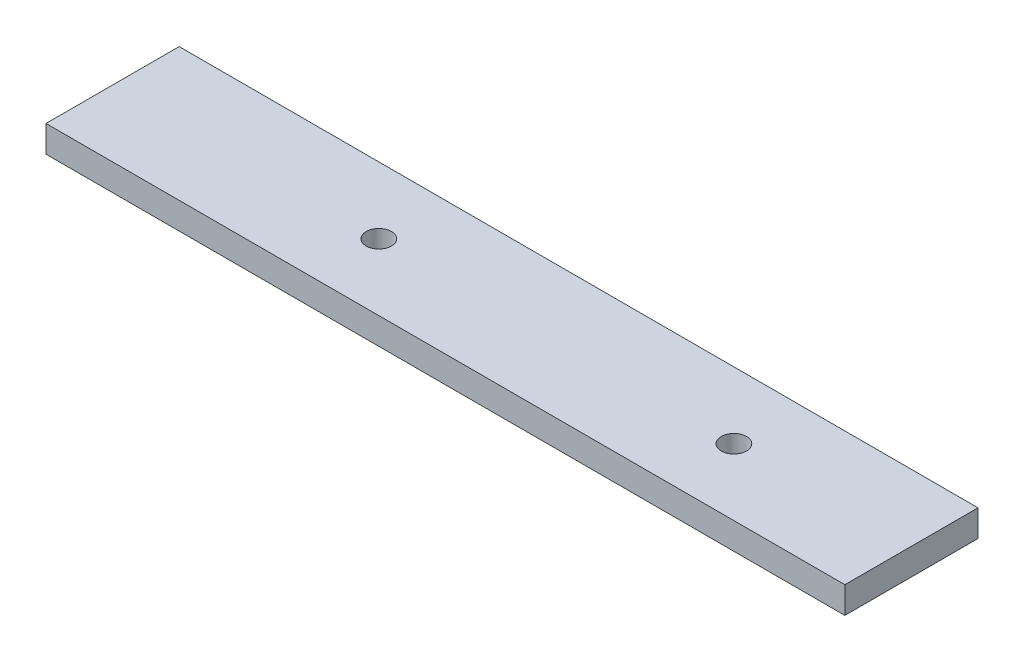
ISO-10303-21;
HEADER;
FILE_DESCRIPTION(('STEP AP214'),'2;1');
FILE_NAME('part.step','',(''),(''),'','','');
FILE_SCHEMA(('AUTOMOTIVE_DESIGN { 1 0 10303 214 1 1 1 1 }'));
ENDSEC;
DATA;
#1=APPLICATION_CONTEXT('core data for automotive mechanical design processes');
#2=APPLICATION_PROTOCOL_DEFINITION('international standard','automotive_design',2000,#1);
#3=PRODUCT_CONTEXT('',#1,'mechanical');
#4=PRODUCT('Part','Part','',(#3));
#5=PRODUCT_RELATED_PRODUCT_CATEGORY('part','',(#4));
#6=PRODUCT_DEFINITION_FORMATION('','',#4);
#7=PRODUCT_DEFINITION_CONTEXT('part definition',#1,'design');
#8=PRODUCT_DEFINITION('design','',#6,#7);
#9=PRODUCT_DEFINITION_SHAPE('','',#8);
#10=(LENGTH_UNIT() NAMED_UNIT(*) SI_UNIT(.MILLI.,.METRE.));
#11=(NAMED_UNIT(*) PLANE_ANGLE_UNIT() SI_UNIT($,.RADIAN.));
#12=(NAMED_UNIT(*) SI_UNIT($,.STERADIAN.) SOLID_ANGLE_UNIT());
#13=UNCERTAINTY_MEASURE_WITH_UNIT(LENGTH_MEASURE(1.E-05),#10,'distance_accuracy_value','');
#14=(GEOMETRIC_REPRESENTATION_CONTEXT(3) GLOBAL_UNCERTAINTY_ASSIGNED_CONTEXT((#13)) GLOBAL_UNIT_ASSIGNED_CONTEXT((#10,
#11,#12)) REPRESENTATION_CONTEXT('',''));
#15=CARTESIAN_POINT('',(0.,0.,0.));
#16=DIRECTION('',(0.,0.,1.));
#17=DIRECTION('',(1.,0.,0.));
#18=AXIS2_PLACEMENT_3D('',#15,#16,#17);
#19=CARTESIAN_POINT('',(-50.,3.,7.5));
#20=DIRECTION('',(0.,0.,-1.));
#21=DIRECTION('',(-1.,0.,0.));
#22=AXIS2_PLACEMENT_3D('',#19,#20,#21);
#23=PLANE('',#22);
#24=DIRECTION('',(1.,0.,0.));
#25=VECTOR('',#24,1.);
#26=CARTESIAN_POINT('',(-50.,3.,7.5));
#27=LINE('',#26,#25);
#28=CARTESIAN_POINT('',(-20.,3.,7.5));
#29=VERTEX_POINT('',#28);
#30=CARTESIAN_POINT('',(70.,3.,7.5));
#31=VERTEX_POINT('',#30);
#32=EDGE_CURVE('E11',#29,#31,#27,.T.);
#33=ORIENTED_EDGE('',*,*,#32,.F.);
#34=DIRECTION('',(0.,1.,0.));
#35=VECTOR('',#34,1.);
#36=CARTESIAN_POINT('',(-20.,-17.,7.5));
#37=LINE('',#36,#35);
#38=CARTESIAN_POINT('',(-20.,0.,7.5));
#39=VERTEX_POINT('',#38);
#40=EDGE_CURVE('E80',#39,#29,#37,.T.);
#41=ORIENTED_EDGE('',*,*,#40,.F.);
#42=DIRECTION('',(1.,0.,0.));
#43=VECTOR('',#42,1.);
#44=CARTESIAN_POINT('',(-50.,0.,7.5));
#45=LINE('',#44,#43);
#46=CARTESIAN_POINT('',(70.,0.,7.5));
#47=VERTEX_POINT('',#46);
#48=EDGE_CURVE('E96',#39,#47,#45,.T.);
#49=ORIENTED_EDGE('',*,*,#48,.T.);
#50=DIRECTION('',(0.,-1.,0.));
#51=VECTOR('',#50,1.);
#52=CARTESIAN_POINT('',(70.,3.,7.5));
#53=LINE('',#52,#51);
#54=EDGE_CURVE('E95',#31,#47,#53,.T.);
#55=ORIENTED_EDGE('',*,*,#54,.F.);
#56=EDGE_LOOP('',(#33,#41,#49,#55));
#57=FACE_BOUND('',#56,.T.);
#58=ADVANCED_FACE('F39',(#57),#23,.F.);
#59=CARTESIAN_POINT('',(0.,3.,0.));
#60=DIRECTION('',(0.,-1.,0.));
#61=DIRECTION('',(0.,0.,-1.));
#62=AXIS2_PLACEMENT_3D('',#59,#60,#61);
#63=PLANE('',#62);
#64=CARTESIAN_POINT('',(50.,3.,0.));
#65=DIRECTION('',(0.,1.,0.));
#66=DIRECTION('',(0.,0.,1.));
#67=AXIS2_PLACEMENT_3D('',#64,#65,#66);
#68=CIRCLE('',#67,1.425);
#69=CARTESIAN_POINT('',(50.,3.,1.425));
#70=VERTEX_POINT('',#69);
#71=EDGE_CURVE('E125',#70,#70,#68,.T.);
#72=ORIENTED_EDGE('',*,*,#71,.F.);
#73=EDGE_LOOP('',(#72));
#74=FACE_BOUND('',#73,.T.);
#75=CARTESIAN_POINT('',(9.99999999999999,3.,0.));
#76=DIRECTION('',(0.,1.,0.));
#77=DIRECTION('',(0.,0.,1.));
#78=AXIS2_PLACEMENT_3D('',#75,#76,#77);
#79=CIRCLE('',#78,1.425);
#80=CARTESIAN_POINT('',(9.99999999999999,3.,1.425));
#81=VERTEX_POINT('',#80);
#82=EDGE_CURVE('E132',#81,#81,#79,.T.);
#83=ORIENTED_EDGE('',*,*,#82,.F.);
#84=EDGE_LOOP('',(#83));
#85=FACE_BOUND('',#84,.T.);
#86=DIRECTION('',(-1.,0.,0.));
#87=VECTOR('',#86,1.);
#88=CARTESIAN_POINT('',(-50.,3.,-7.5));
#89=LINE('',#88,#87);
#90=CARTESIAN_POINT('',(70.,3.,-7.5));
#91=VERTEX_POINT('',#90);
#92=CARTESIAN_POINT('',(-20.,3.,-7.5));
#93=VERTEX_POINT('',#92);
#94=EDGE_CURVE('E49',#91,#93,#89,.T.);
#95=ORIENTED_EDGE('',*,*,#94,.T.);
#96=DIRECTION('',(0.,0.,-1.));
#97=VECTOR('',#96,1.);
#98=CARTESIAN_POINT('',(-20.,3.,-7.5));
#99=LINE('',#98,#97);
#100=EDGE_CURVE('E57',#29,#93,#99,.T.);
#101=ORIENTED_EDGE('',*,*,#100,.F.);
#102=ORIENTED_EDGE('',*,*,#32,.T.);
#103=DIRECTION('',(0.,0.,1.));
#104=VECTOR('',#103,1.);
#105=CARTESIAN_POINT('',(70.,3.,7.5));
#106=LINE('',#105,#104);
#107=EDGE_CURVE('E112',#91,#31,#106,.T.);
#108=ORIENTED_EDGE('',*,*,#107,.F.);
#109=EDGE_LOOP('',(#95,#101,#102,#108));
#110=FACE_BOUND('',#109,.T.);
#111=ADVANCED_FACE('F90',(#74,#85,#110),#63,.F.);
#112=CARTESIAN_POINT('',(0.,0.,0.));
#113=DIRECTION('',(0.,-1.,0.));
#114=DIRECTION('',(0.,0.,-1.));
#115=AXIS2_PLACEMENT_3D('',#112,#113,#114);
#116=PLANE('',#115);
#117=CARTESIAN_POINT('',(50.,0.,0.));
#118=DIRECTION('',(0.,-1.,0.));
#119=DIRECTION('',(0.,0.,-1.));
#120=AXIS2_PLACEMENT_3D('',#117,#118,#119);
#121=CIRCLE('',#120,1.425);
#122=CARTESIAN_POINT('',(50.,0.,-1.425));
#123=VERTEX_POINT('',#122);
#124=EDGE_CURVE('E43',#123,#123,#121,.T.);
#125=ORIENTED_EDGE('',*,*,#124,.F.);
#126=EDGE_LOOP('',(#125));
#127=FACE_BOUND('',#126,.T.);
#128=CARTESIAN_POINT('',(9.99999999999999,0.,0.));
#129=DIRECTION('',(0.,-1.,0.));
#130=DIRECTION('',(0.,0.,-1.));
#131=AXIS2_PLACEMENT_3D('',#128,#129,#130);
#132=CIRCLE('',#131,1.425);
#133=CARTESIAN_POINT('',(9.99999999999999,0.,-1.425));
#134=VERTEX_POINT('',#133);
#135=EDGE_CURVE('E122',#134,#134,#132,.T.);
#136=ORIENTED_EDGE('',*,*,#135,.F.);
#137=EDGE_LOOP('',(#136));
#138=FACE_BOUND('',#137,.T.);
#139=DIRECTION('',(0.,0.,1.));
#140=VECTOR('',#139,1.);
#141=CARTESIAN_POINT('',(-20.,0.,0.));
#142=LINE('',#141,#140);
#143=CARTESIAN_POINT('',(-20.,0.,-7.5));
#144=VERTEX_POINT('',#143);
#145=EDGE_CURVE('E83',#144,#39,#142,.T.);
#146=ORIENTED_EDGE('',*,*,#145,.F.);
#147=DIRECTION('',(-1.,0.,0.));
#148=VECTOR('',#147,1.);
#149=CARTESIAN_POINT('',(-50.,0.,-7.5));
#150=LINE('',#149,#148);
#151=CARTESIAN_POINT('',(70.,0.,-7.5));
#152=VERTEX_POINT('',#151);
#153=EDGE_CURVE('E115',#152,#144,#150,.T.);
#154=ORIENTED_EDGE('',*,*,#153,.F.);
#155=DIRECTION('',(0.,0.,-1.));
#156=VECTOR('',#155,1.);
#157=CARTESIAN_POINT('',(70.,0.,7.5));
#158=LINE('',#157,#156);
#159=EDGE_CURVE('E101',#47,#152,#158,.T.);
#160=ORIENTED_EDGE('',*,*,#159,.F.);
#161=ORIENTED_EDGE('',*,*,#48,.F.);
#162=EDGE_LOOP('',(#146,#154,#160,#161));
#163=FACE_BOUND('',#162,.T.);
#164=ADVANCED_FACE('F144',(#127,#138,#163),#116,.T.);
#165=CARTESIAN_POINT('',(-50.,3.,-7.5));
#166=DIRECTION('',(0.,0.,1.));
#167=DIRECTION('',(1.,0.,0.));
#168=AXIS2_PLACEMENT_3D('',#165,#166,#167);
#169=PLANE('',#168);
#170=ORIENTED_EDGE('',*,*,#153,.T.);
#171=DIRECTION('',(0.,1.,0.));
#172=VECTOR('',#171,1.);
#173=CARTESIAN_POINT('',(-20.,-17.,-7.5));
#174=LINE('',#173,#172);
#175=EDGE_CURVE('E87',#144,#93,#174,.T.);
#176=ORIENTED_EDGE('',*,*,#175,.T.);
#177=ORIENTED_EDGE('',*,*,#94,.F.);
#178=DIRECTION('',(0.,1.,0.));
#179=VECTOR('',#178,1.);
#180=CARTESIAN_POINT('',(70.,3.,-7.5));
#181=LINE('',#180,#179);
#182=EDGE_CURVE('E105',#152,#91,#181,.T.);
#183=ORIENTED_EDGE('',*,*,#182,.F.);
#184=EDGE_LOOP('',(#170,#176,#177,#183));
#185=FACE_BOUND('',#184,.T.);
#186=ADVANCED_FACE('F41',(#185),#169,.F.);
#187=CARTESIAN_POINT('',(70.,0.,0.));
#188=DIRECTION('',(1.,0.,0.));
#189=DIRECTION('',(0.,0.,-1.));
#190=AXIS2_PLACEMENT_3D('',#187,#188,#189);
#191=PLANE('',#190);
#192=ORIENTED_EDGE('',*,*,#54,.T.);
#193=ORIENTED_EDGE('',*,*,#159,.T.);
#194=ORIENTED_EDGE('',*,*,#182,.T.);
#195=ORIENTED_EDGE('',*,*,#107,.T.);
#196=EDGE_LOOP('',(#192,#193,#194,#195));
#197=FACE_BOUND('',#196,.T.);
#198=ADVANCED_FACE('F145',(#197),#191,.T.);
#199=CARTESIAN_POINT('',(-20.,-17.,-7.5));
#200=DIRECTION('',(1.,0.,0.));
#201=DIRECTION('',(0.,0.,-1.));
#202=AXIS2_PLACEMENT_3D('',#199,#200,#201);
#203=PLANE('',#202);
#204=ORIENTED_EDGE('',*,*,#145,.T.);
#205=ORIENTED_EDGE('',*,*,#40,.T.);
#206=ORIENTED_EDGE('',*,*,#100,.T.);
#207=ORIENTED_EDGE('',*,*,#175,.F.);
#208=EDGE_LOOP('',(#204,#205,#206,#207));
#209=FACE_BOUND('',#208,.T.);
#210=ADVANCED_FACE('F81',(#209),#203,.F.);
#211=CARTESIAN_POINT('',(9.99999999999999,-17.,0.));
#212=DIRECTION('',(0.,1.,0.));
#213=DIRECTION('',(0.,0.,1.));
#214=AXIS2_PLACEMENT_3D('',#211,#212,#213);
#215=CYLINDRICAL_SURFACE('',#214,1.425);
#216=ORIENTED_EDGE('',*,*,#135,.T.);
#217=EDGE_LOOP('',(#216));
#218=FACE_BOUND('',#217,.T.);
#219=ORIENTED_EDGE('',*,*,#82,.T.);
#220=EDGE_LOOP('',(#219));
#221=FACE_BOUND('',#220,.T.);
#222=ADVANCED_FACE('F152',(#218,#221),#215,.F.);
#223=CARTESIAN_POINT('',(50.,-17.,0.));
#224=DIRECTION('',(0.,1.,0.));
#225=DIRECTION('',(0.,0.,1.));
#226=AXIS2_PLACEMENT_3D('',#223,#224,#225);
#227=CYLINDRICAL_SURFACE('',#226,1.425);
#228=ORIENTED_EDGE('',*,*,#124,.T.);
#229=EDGE_LOOP('',(#228));
#230=FACE_BOUND('',#229,.T.);
#231=ORIENTED_EDGE('',*,*,#71,.T.);
#232=EDGE_LOOP('',(#231));
#233=FACE_BOUND('',#232,.T.);
#234=ADVANCED_FACE('F168',(#230,#233),#227,.F.);
#235=CLOSED_SHELL('',(#58,#111,#164,#186,#198,#210,#222,#234));
#236=MANIFOLD_SOLID_BREP('B2',#235);
#237=ADVANCED_BREP_SHAPE_REPRESENTATION('',(#18,#236),#14);
#238=SHAPE_DEFINITION_REPRESENTATION(#9,#237);
ENDSEC;
END-ISO-10303-21;
